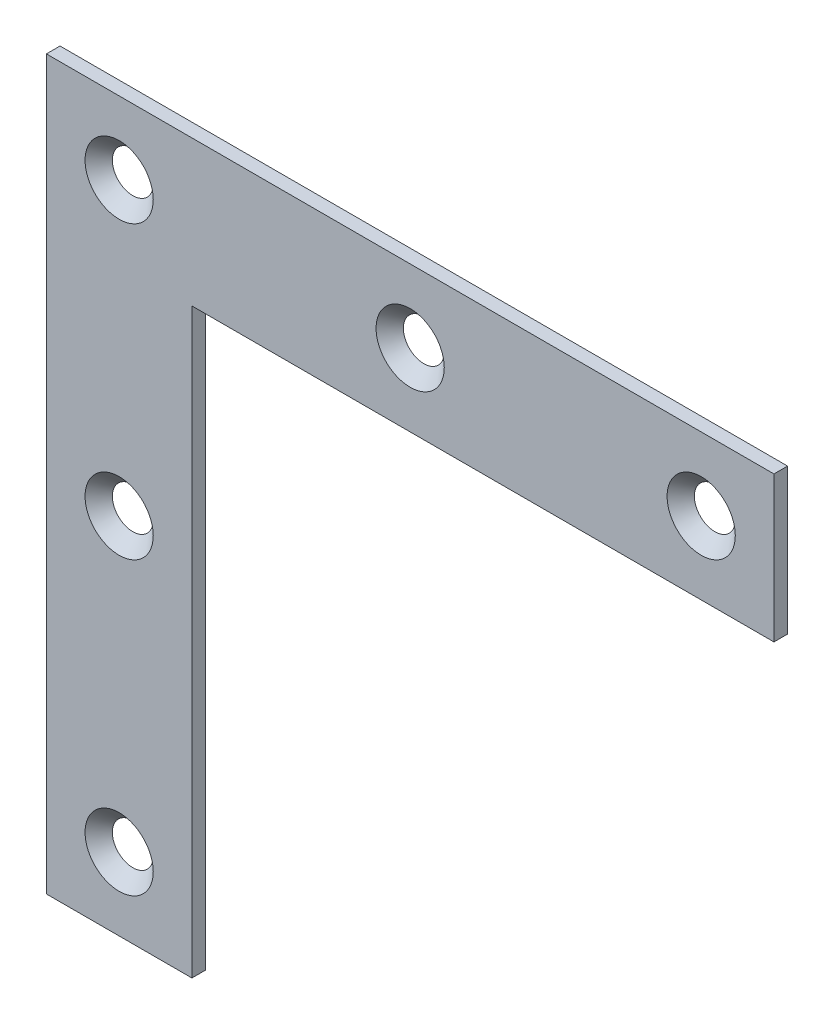
ISO-10303-21;
HEADER;
FILE_DESCRIPTION(('STEP AP214'),'2;1');
FILE_NAME('part.step','',(''),(''),'','','');
FILE_SCHEMA(('AUTOMOTIVE_DESIGN { 1 0 10303 214 1 1 1 1 }'));
ENDSEC;
DATA;
#1=APPLICATION_CONTEXT('core data for automotive mechanical design processes');
#2=APPLICATION_PROTOCOL_DEFINITION('international standard','automotive_design',2000,#1);
#3=PRODUCT_CONTEXT('',#1,'mechanical');
#4=PRODUCT('Part','Part','',(#3));
#5=PRODUCT_RELATED_PRODUCT_CATEGORY('part','',(#4));
#6=PRODUCT_DEFINITION_FORMATION('','',#4);
#7=PRODUCT_DEFINITION_CONTEXT('part definition',#1,'design');
#8=PRODUCT_DEFINITION('design','',#6,#7);
#9=PRODUCT_DEFINITION_SHAPE('','',#8);
#10=(LENGTH_UNIT() NAMED_UNIT(*) SI_UNIT(.MILLI.,.METRE.));
#11=(NAMED_UNIT(*) PLANE_ANGLE_UNIT() SI_UNIT($,.RADIAN.));
#12=(NAMED_UNIT(*) SI_UNIT($,.STERADIAN.) SOLID_ANGLE_UNIT());
#13=UNCERTAINTY_MEASURE_WITH_UNIT(LENGTH_MEASURE(1.E-05),#10,'distance_accuracy_value','');
#14=(GEOMETRIC_REPRESENTATION_CONTEXT(3) GLOBAL_UNCERTAINTY_ASSIGNED_CONTEXT((#13)) GLOBAL_UNIT_ASSIGNED_CONTEXT((#10,
#11,#12)) REPRESENTATION_CONTEXT('',''));
#15=CARTESIAN_POINT('',(0.,0.,0.));
#16=DIRECTION('',(0.,0.,1.));
#17=DIRECTION('',(1.,0.,0.));
#18=AXIS2_PLACEMENT_3D('',#15,#16,#17);
#19=CARTESIAN_POINT('',(80.,0.,0.));
#20=DIRECTION('',(0.,1.,0.));
#21=DIRECTION('',(0.,0.,1.));
#22=AXIS2_PLACEMENT_3D('',#19,#20,#21);
#23=PLANE('',#22);
#24=DIRECTION('',(-1.,0.,0.));
#25=VECTOR('',#24,1.);
#26=CARTESIAN_POINT('',(80.,0.,1.5));
#27=LINE('',#26,#25);
#28=CARTESIAN_POINT('',(80.,0.,1.5));
#29=VERTEX_POINT('',#28);
#30=CARTESIAN_POINT('',(0.,0.,1.5));
#31=VERTEX_POINT('',#30);
#32=EDGE_CURVE('E123',#29,#31,#27,.T.);
#33=ORIENTED_EDGE('',*,*,#32,.F.);
#34=DIRECTION('',(0.,0.,1.));
#35=VECTOR('',#34,1.);
#36=CARTESIAN_POINT('',(80.,0.,0.));
#37=LINE('',#36,#35);
#38=CARTESIAN_POINT('',(80.,0.,0.));
#39=VERTEX_POINT('',#38);
#40=EDGE_CURVE('E11',#39,#29,#37,.T.);
#41=ORIENTED_EDGE('',*,*,#40,.F.);
#42=DIRECTION('',(-1.,0.,0.));
#43=VECTOR('',#42,1.);
#44=CARTESIAN_POINT('',(80.,0.,0.));
#45=LINE('',#44,#43);
#46=CARTESIAN_POINT('',(0.,0.,0.));
#47=VERTEX_POINT('',#46);
#48=EDGE_CURVE('E121',#39,#47,#45,.T.);
#49=ORIENTED_EDGE('',*,*,#48,.T.);
#50=DIRECTION('',(0.,0.,1.));
#51=VECTOR('',#50,1.);
#52=CARTESIAN_POINT('',(0.,0.,0.));
#53=LINE('',#52,#51);
#54=EDGE_CURVE('E40',#47,#31,#53,.T.);
#55=ORIENTED_EDGE('',*,*,#54,.T.);
#56=EDGE_LOOP('',(#33,#41,#49,#55));
#57=FACE_BOUND('',#56,.T.);
#58=ADVANCED_FACE('F37',(#57),#23,.T.);
#59=CARTESIAN_POINT('',(80.,-80.,0.));
#60=DIRECTION('',(1.,0.,0.));
#61=DIRECTION('',(0.,0.,-1.));
#62=AXIS2_PLACEMENT_3D('',#59,#60,#61);
#63=PLANE('',#62);
#64=DIRECTION('',(0.,0.,-1.));
#65=VECTOR('',#64,1.);
#66=CARTESIAN_POINT('',(80.,-16.,1.5));
#67=LINE('',#66,#65);
#68=CARTESIAN_POINT('',(80.,-16.,1.5));
#69=VERTEX_POINT('',#68);
#70=CARTESIAN_POINT('',(80.,-16.,0.));
#71=VERTEX_POINT('',#70);
#72=EDGE_CURVE('E133',#69,#71,#67,.T.);
#73=ORIENTED_EDGE('',*,*,#72,.T.);
#74=DIRECTION('',(0.,1.,0.));
#75=VECTOR('',#74,1.);
#76=CARTESIAN_POINT('',(80.,-80.,0.));
#77=LINE('',#76,#75);
#78=EDGE_CURVE('E61',#71,#39,#77,.T.);
#79=ORIENTED_EDGE('',*,*,#78,.T.);
#80=ORIENTED_EDGE('',*,*,#40,.T.);
#81=DIRECTION('',(0.,1.,0.));
#82=VECTOR('',#81,1.);
#83=CARTESIAN_POINT('',(80.,-80.,1.5));
#84=LINE('',#83,#82);
#85=EDGE_CURVE('E79',#69,#29,#84,.T.);
#86=ORIENTED_EDGE('',*,*,#85,.F.);
#87=EDGE_LOOP('',(#73,#79,#80,#86));
#88=FACE_BOUND('',#87,.T.);
#89=ADVANCED_FACE('F143',(#88),#63,.T.);
#90=CARTESIAN_POINT('',(0.,-80.,0.));
#91=DIRECTION('',(0.,-1.,0.));
#92=DIRECTION('',(0.,0.,-1.));
#93=AXIS2_PLACEMENT_3D('',#90,#91,#92);
#94=PLANE('',#93);
#95=DIRECTION('',(0.,0.,-1.));
#96=VECTOR('',#95,1.);
#97=CARTESIAN_POINT('',(16.,-80.,1.5));
#98=LINE('',#97,#96);
#99=CARTESIAN_POINT('',(16.,-80.,1.5));
#100=VERTEX_POINT('',#99);
#101=CARTESIAN_POINT('',(16.,-80.,0.));
#102=VERTEX_POINT('',#101);
#103=EDGE_CURVE('E103',#100,#102,#98,.T.);
#104=ORIENTED_EDGE('',*,*,#103,.F.);
#105=DIRECTION('',(1.,0.,0.));
#106=VECTOR('',#105,1.);
#107=CARTESIAN_POINT('',(0.,-80.,1.5));
#108=LINE('',#107,#106);
#109=CARTESIAN_POINT('',(0.,-80.,1.5));
#110=VERTEX_POINT('',#109);
#111=EDGE_CURVE('E113',#110,#100,#108,.T.);
#112=ORIENTED_EDGE('',*,*,#111,.F.);
#113=DIRECTION('',(0.,0.,1.));
#114=VECTOR('',#113,1.);
#115=CARTESIAN_POINT('',(0.,-80.,0.));
#116=LINE('',#115,#114);
#117=CARTESIAN_POINT('',(0.,-80.,0.));
#118=VERTEX_POINT('',#117);
#119=EDGE_CURVE('E45',#118,#110,#116,.T.);
#120=ORIENTED_EDGE('',*,*,#119,.F.);
#121=DIRECTION('',(1.,0.,0.));
#122=VECTOR('',#121,1.);
#123=CARTESIAN_POINT('',(0.,-80.,0.));
#124=LINE('',#123,#122);
#125=EDGE_CURVE('E116',#118,#102,#124,.T.);
#126=ORIENTED_EDGE('',*,*,#125,.T.);
#127=EDGE_LOOP('',(#104,#112,#120,#126));
#128=FACE_BOUND('',#127,.T.);
#129=ADVANCED_FACE('F112',(#128),#94,.T.);
#130=CARTESIAN_POINT('',(0.,0.,0.));
#131=DIRECTION('',(-1.,0.,0.));
#132=DIRECTION('',(0.,-1.,0.));
#133=AXIS2_PLACEMENT_3D('',#130,#131,#132);
#134=PLANE('',#133);
#135=DIRECTION('',(0.,-1.,0.));
#136=VECTOR('',#135,1.);
#137=CARTESIAN_POINT('',(0.,0.,1.5));
#138=LINE('',#137,#136);
#139=EDGE_CURVE('E119',#31,#110,#138,.T.);
#140=ORIENTED_EDGE('',*,*,#139,.F.);
#141=ORIENTED_EDGE('',*,*,#54,.F.);
#142=DIRECTION('',(0.,-1.,0.));
#143=VECTOR('',#142,1.);
#144=CARTESIAN_POINT('',(0.,0.,0.));
#145=LINE('',#144,#143);
#146=EDGE_CURVE('E130',#47,#118,#145,.T.);
#147=ORIENTED_EDGE('',*,*,#146,.T.);
#148=ORIENTED_EDGE('',*,*,#119,.T.);
#149=EDGE_LOOP('',(#140,#141,#147,#148));
#150=FACE_BOUND('',#149,.T.);
#151=ADVANCED_FACE('F139',(#150),#134,.T.);
#152=CARTESIAN_POINT('',(0.,0.,0.));
#153=DIRECTION('',(0.,0.,1.));
#154=DIRECTION('',(1.,0.,0.));
#155=AXIS2_PLACEMENT_3D('',#152,#153,#154);
#156=PLANE('',#155);
#157=CARTESIAN_POINT('',(8.,-8.,0.));
#158=DIRECTION('',(0.,0.,1.));
#159=DIRECTION('',(1.,0.,0.));
#160=AXIS2_PLACEMENT_3D('',#157,#158,#159);
#161=CIRCLE('',#160,2.25000000000001);
#162=CARTESIAN_POINT('',(10.25,-8.,0.));
#163=VERTEX_POINT('',#162);
#164=EDGE_CURVE('E193',#163,#163,#161,.T.);
#165=ORIENTED_EDGE('',*,*,#164,.T.);
#166=EDGE_LOOP('',(#165));
#167=FACE_BOUND('',#166,.T.);
#168=CARTESIAN_POINT('',(40.,-8.,0.));
#169=DIRECTION('',(0.,0.,1.));
#170=DIRECTION('',(1.,0.,0.));
#171=AXIS2_PLACEMENT_3D('',#168,#169,#170);
#172=CIRCLE('',#171,2.25000000000002);
#173=CARTESIAN_POINT('',(42.25,-8.,0.));
#174=VERTEX_POINT('',#173);
#175=EDGE_CURVE('E203',#174,#174,#172,.T.);
#176=ORIENTED_EDGE('',*,*,#175,.T.);
#177=EDGE_LOOP('',(#176));
#178=FACE_BOUND('',#177,.T.);
#179=CARTESIAN_POINT('',(72.,-8.,0.));
#180=DIRECTION('',(0.,0.,1.));
#181=DIRECTION('',(1.,0.,0.));
#182=AXIS2_PLACEMENT_3D('',#179,#180,#181);
#183=CIRCLE('',#182,2.25000000000002);
#184=CARTESIAN_POINT('',(74.25,-8.,0.));
#185=VERTEX_POINT('',#184);
#186=EDGE_CURVE('E209',#185,#185,#183,.T.);
#187=ORIENTED_EDGE('',*,*,#186,.T.);
#188=EDGE_LOOP('',(#187));
#189=FACE_BOUND('',#188,.T.);
#190=CARTESIAN_POINT('',(8.,-40.,0.));
#191=DIRECTION('',(0.,0.,1.));
#192=DIRECTION('',(1.,0.,0.));
#193=AXIS2_PLACEMENT_3D('',#190,#191,#192);
#194=CIRCLE('',#193,2.25000000000001);
#195=CARTESIAN_POINT('',(10.25,-40.,0.));
#196=VERTEX_POINT('',#195);
#197=EDGE_CURVE('E215',#196,#196,#194,.T.);
#198=ORIENTED_EDGE('',*,*,#197,.T.);
#199=EDGE_LOOP('',(#198));
#200=FACE_BOUND('',#199,.T.);
#201=CARTESIAN_POINT('',(8.,-72.,0.));
#202=DIRECTION('',(0.,0.,1.));
#203=DIRECTION('',(1.,0.,0.));
#204=AXIS2_PLACEMENT_3D('',#201,#202,#203);
#205=CIRCLE('',#204,2.25000000000001);
#206=CARTESIAN_POINT('',(10.25,-72.,0.));
#207=VERTEX_POINT('',#206);
#208=EDGE_CURVE('E221',#207,#207,#205,.T.);
#209=ORIENTED_EDGE('',*,*,#208,.T.);
#210=EDGE_LOOP('',(#209));
#211=FACE_BOUND('',#210,.T.);
#212=ORIENTED_EDGE('',*,*,#78,.F.);
#213=DIRECTION('',(1.,0.,0.));
#214=VECTOR('',#213,1.);
#215=CARTESIAN_POINT('',(16.,-16.,0.));
#216=LINE('',#215,#214);
#217=CARTESIAN_POINT('',(16.,-16.,0.));
#218=VERTEX_POINT('',#217);
#219=EDGE_CURVE('E107',#218,#71,#216,.T.);
#220=ORIENTED_EDGE('',*,*,#219,.F.);
#221=DIRECTION('',(0.,1.,0.));
#222=VECTOR('',#221,1.);
#223=CARTESIAN_POINT('',(16.,-80.,0.));
#224=LINE('',#223,#222);
#225=EDGE_CURVE('E223',#102,#218,#224,.T.);
#226=ORIENTED_EDGE('',*,*,#225,.F.);
#227=ORIENTED_EDGE('',*,*,#125,.F.);
#228=ORIENTED_EDGE('',*,*,#146,.F.);
#229=ORIENTED_EDGE('',*,*,#48,.F.);
#230=EDGE_LOOP('',(#212,#220,#226,#227,#228,#229));
#231=FACE_BOUND('',#230,.T.);
#232=ADVANCED_FACE('F142',(#167,#178,#189,#200,#211,#231),#156,.F.);
#233=CARTESIAN_POINT('',(0.,0.,1.5));
#234=DIRECTION('',(0.,0.,1.));
#235=DIRECTION('',(1.,0.,0.));
#236=AXIS2_PLACEMENT_3D('',#233,#234,#235);
#237=PLANE('',#236);
#238=CARTESIAN_POINT('',(8.,-8.,1.5));
#239=DIRECTION('',(0.,0.,1.));
#240=DIRECTION('',(1.,0.,0.));
#241=AXIS2_PLACEMENT_3D('',#238,#239,#240);
#242=CIRCLE('',#241,3.75000000000001);
#243=CARTESIAN_POINT('',(11.75,-8.,1.5));
#244=VERTEX_POINT('',#243);
#245=EDGE_CURVE('E196',#244,#244,#242,.T.);
#246=ORIENTED_EDGE('',*,*,#245,.F.);
#247=EDGE_LOOP('',(#246));
#248=FACE_BOUND('',#247,.T.);
#249=CARTESIAN_POINT('',(40.,-8.,1.5));
#250=DIRECTION('',(0.,0.,1.));
#251=DIRECTION('',(1.,0.,0.));
#252=AXIS2_PLACEMENT_3D('',#249,#250,#251);
#253=CIRCLE('',#252,3.75000000000001);
#254=CARTESIAN_POINT('',(43.75,-8.,1.5));
#255=VERTEX_POINT('',#254);
#256=EDGE_CURVE('E198',#255,#255,#253,.T.);
#257=ORIENTED_EDGE('',*,*,#256,.F.);
#258=EDGE_LOOP('',(#257));
#259=FACE_BOUND('',#258,.T.);
#260=CARTESIAN_POINT('',(72.,-8.,1.5));
#261=DIRECTION('',(0.,0.,1.));
#262=DIRECTION('',(1.,0.,0.));
#263=AXIS2_PLACEMENT_3D('',#260,#261,#262);
#264=CIRCLE('',#263,3.75000000000002);
#265=CARTESIAN_POINT('',(75.75,-8.,1.5));
#266=VERTEX_POINT('',#265);
#267=EDGE_CURVE('E206',#266,#266,#264,.T.);
#268=ORIENTED_EDGE('',*,*,#267,.F.);
#269=EDGE_LOOP('',(#268));
#270=FACE_BOUND('',#269,.T.);
#271=CARTESIAN_POINT('',(8.,-40.,1.5));
#272=DIRECTION('',(0.,0.,1.));
#273=DIRECTION('',(1.,0.,0.));
#274=AXIS2_PLACEMENT_3D('',#271,#272,#273);
#275=CIRCLE('',#274,3.75000000000001);
#276=CARTESIAN_POINT('',(11.75,-40.,1.5));
#277=VERTEX_POINT('',#276);
#278=EDGE_CURVE('E212',#277,#277,#275,.T.);
#279=ORIENTED_EDGE('',*,*,#278,.F.);
#280=EDGE_LOOP('',(#279));
#281=FACE_BOUND('',#280,.T.);
#282=CARTESIAN_POINT('',(8.,-72.,1.5));
#283=DIRECTION('',(0.,0.,1.));
#284=DIRECTION('',(1.,0.,0.));
#285=AXIS2_PLACEMENT_3D('',#282,#283,#284);
#286=CIRCLE('',#285,3.75000000000001);
#287=CARTESIAN_POINT('',(11.75,-72.,1.5));
#288=VERTEX_POINT('',#287);
#289=EDGE_CURVE('E218',#288,#288,#286,.T.);
#290=ORIENTED_EDGE('',*,*,#289,.F.);
#291=EDGE_LOOP('',(#290));
#292=FACE_BOUND('',#291,.T.);
#293=DIRECTION('',(1.,0.,0.));
#294=VECTOR('',#293,1.);
#295=CARTESIAN_POINT('',(16.,-16.,1.5));
#296=LINE('',#295,#294);
#297=CARTESIAN_POINT('',(16.,-16.,1.5));
#298=VERTEX_POINT('',#297);
#299=EDGE_CURVE('E53',#298,#69,#296,.T.);
#300=ORIENTED_EDGE('',*,*,#299,.T.);
#301=ORIENTED_EDGE('',*,*,#85,.T.);
#302=ORIENTED_EDGE('',*,*,#32,.T.);
#303=ORIENTED_EDGE('',*,*,#139,.T.);
#304=ORIENTED_EDGE('',*,*,#111,.T.);
#305=DIRECTION('',(0.,1.,0.));
#306=VECTOR('',#305,1.);
#307=CARTESIAN_POINT('',(16.,-80.,1.5));
#308=LINE('',#307,#306);
#309=EDGE_CURVE('E99',#100,#298,#308,.T.);
#310=ORIENTED_EDGE('',*,*,#309,.T.);
#311=EDGE_LOOP('',(#300,#301,#302,#303,#304,#310));
#312=FACE_BOUND('',#311,.T.);
#313=ADVANCED_FACE('F118',(#248,#259,#270,#281,#292,#312),#237,.T.);
#314=CARTESIAN_POINT('',(16.,-16.,1.5));
#315=DIRECTION('',(0.,1.,0.));
#316=DIRECTION('',(0.,0.,1.));
#317=AXIS2_PLACEMENT_3D('',#314,#315,#316);
#318=PLANE('',#317);
#319=ORIENTED_EDGE('',*,*,#219,.T.);
#320=ORIENTED_EDGE('',*,*,#72,.F.);
#321=ORIENTED_EDGE('',*,*,#299,.F.);
#322=DIRECTION('',(0.,0.,-1.));
#323=VECTOR('',#322,1.);
#324=CARTESIAN_POINT('',(16.,-16.,1.5));
#325=LINE('',#324,#323);
#326=EDGE_CURVE('E105',#298,#218,#325,.T.);
#327=ORIENTED_EDGE('',*,*,#326,.T.);
#328=EDGE_LOOP('',(#319,#320,#321,#327));
#329=FACE_BOUND('',#328,.T.);
#330=ADVANCED_FACE('F161',(#329),#318,.F.);
#331=CARTESIAN_POINT('',(16.,-80.,1.5));
#332=DIRECTION('',(-1.,0.,0.));
#333=DIRECTION('',(0.,0.,1.));
#334=AXIS2_PLACEMENT_3D('',#331,#332,#333);
#335=PLANE('',#334);
#336=ORIENTED_EDGE('',*,*,#225,.T.);
#337=ORIENTED_EDGE('',*,*,#326,.F.);
#338=ORIENTED_EDGE('',*,*,#309,.F.);
#339=ORIENTED_EDGE('',*,*,#103,.T.);
#340=EDGE_LOOP('',(#336,#337,#338,#339));
#341=FACE_BOUND('',#340,.T.);
#342=ADVANCED_FACE('F102',(#341),#335,.F.);
#343=CARTESIAN_POINT('',(8.,-72.,1.5));
#344=DIRECTION('',(0.,0.,1.));
#345=DIRECTION('',(1.,0.,0.));
#346=AXIS2_PLACEMENT_3D('',#343,#344,#345);
#347=CONICAL_SURFACE('',#346,3.75000000000001,0.785398163397448);
#348=ORIENTED_EDGE('',*,*,#208,.F.);
#349=EDGE_LOOP('',(#348));
#350=FACE_BOUND('',#349,.T.);
#351=ORIENTED_EDGE('',*,*,#289,.T.);
#352=EDGE_LOOP('',(#351));
#353=FACE_BOUND('',#352,.T.);
#354=ADVANCED_FACE('F168',(#350,#353),#347,.F.);
#355=CARTESIAN_POINT('',(8.,-40.,1.5));
#356=DIRECTION('',(0.,0.,1.));
#357=DIRECTION('',(1.,0.,0.));
#358=AXIS2_PLACEMENT_3D('',#355,#356,#357);
#359=CONICAL_SURFACE('',#358,3.75000000000001,0.785398163397448);
#360=ORIENTED_EDGE('',*,*,#197,.F.);
#361=EDGE_LOOP('',(#360));
#362=FACE_BOUND('',#361,.T.);
#363=ORIENTED_EDGE('',*,*,#278,.T.);
#364=EDGE_LOOP('',(#363));
#365=FACE_BOUND('',#364,.T.);
#366=ADVANCED_FACE('F173',(#362,#365),#359,.F.);
#367=CARTESIAN_POINT('',(72.,-8.,1.5));
#368=DIRECTION('',(0.,0.,1.));
#369=DIRECTION('',(1.,0.,0.));
#370=AXIS2_PLACEMENT_3D('',#367,#368,#369);
#371=CONICAL_SURFACE('',#370,3.75000000000002,0.785398163397448);
#372=ORIENTED_EDGE('',*,*,#186,.F.);
#373=EDGE_LOOP('',(#372));
#374=FACE_BOUND('',#373,.T.);
#375=ORIENTED_EDGE('',*,*,#267,.T.);
#376=EDGE_LOOP('',(#375));
#377=FACE_BOUND('',#376,.T.);
#378=ADVANCED_FACE('F177',(#374,#377),#371,.F.);
#379=CARTESIAN_POINT('',(40.,-8.,1.5));
#380=DIRECTION('',(0.,0.,1.));
#381=DIRECTION('',(1.,0.,0.));
#382=AXIS2_PLACEMENT_3D('',#379,#380,#381);
#383=CONICAL_SURFACE('',#382,3.75000000000001,0.785398163397446);
#384=ORIENTED_EDGE('',*,*,#175,.F.);
#385=EDGE_LOOP('',(#384));
#386=FACE_BOUND('',#385,.T.);
#387=ORIENTED_EDGE('',*,*,#256,.T.);
#388=EDGE_LOOP('',(#387));
#389=FACE_BOUND('',#388,.T.);
#390=ADVANCED_FACE('F181',(#386,#389),#383,.F.);
#391=CARTESIAN_POINT('',(8.,-8.,1.5));
#392=DIRECTION('',(0.,0.,1.));
#393=DIRECTION('',(1.,0.,0.));
#394=AXIS2_PLACEMENT_3D('',#391,#392,#393);
#395=CONICAL_SURFACE('',#394,3.75000000000001,0.785398163397448);
#396=ORIENTED_EDGE('',*,*,#164,.F.);
#397=EDGE_LOOP('',(#396));
#398=FACE_BOUND('',#397,.T.);
#399=ORIENTED_EDGE('',*,*,#245,.T.);
#400=EDGE_LOOP('',(#399));
#401=FACE_BOUND('',#400,.T.);
#402=ADVANCED_FACE('F185',(#398,#401),#395,.F.);
#403=CLOSED_SHELL('',(#58,#89,#129,#151,#232,#313,#330,#342,#354,#366,#378,#390,#402));
#404=MANIFOLD_SOLID_BREP('B2',#403);
#405=ADVANCED_BREP_SHAPE_REPRESENTATION('',(#18,#404),#14);
#406=SHAPE_DEFINITION_REPRESENTATION(#9,#405);
ENDSEC;
END-ISO-10303-21;
